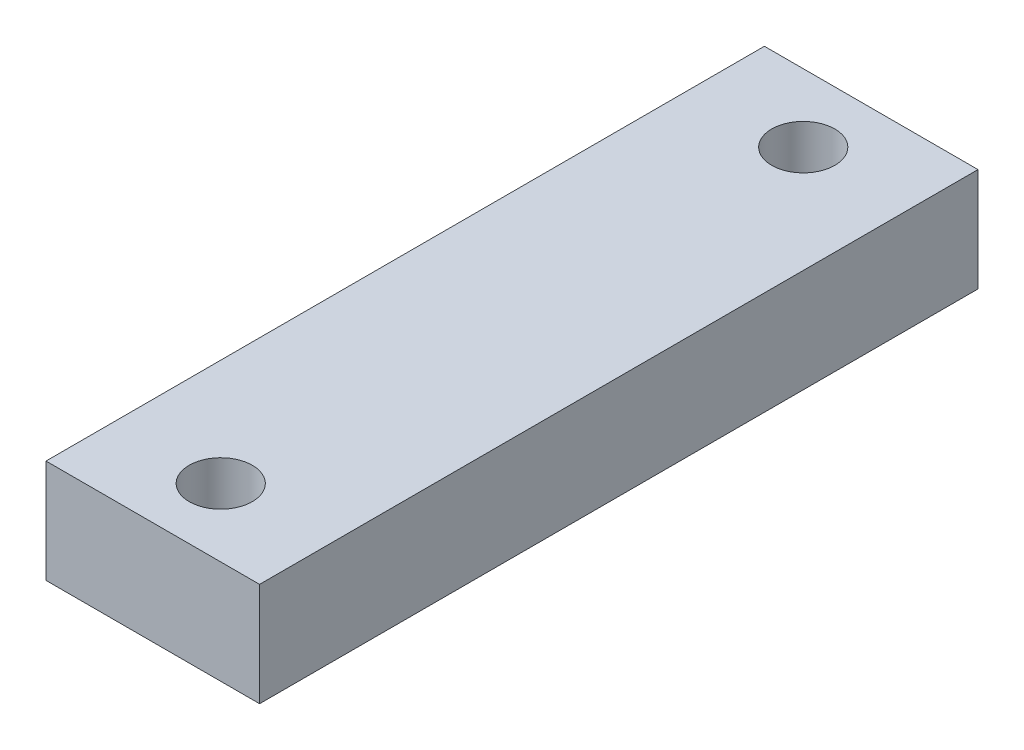
ISO-10303-21;
HEADER;
FILE_DESCRIPTION(('STEP AP214'),'2;1');
FILE_NAME('part.step','',(''),(''),'','','');
FILE_SCHEMA(('AUTOMOTIVE_DESIGN { 1 0 10303 214 1 1 1 1 }'));
ENDSEC;
DATA;
#1=APPLICATION_CONTEXT('core data for automotive mechanical design processes');
#2=APPLICATION_PROTOCOL_DEFINITION('international standard','automotive_design',2000,#1);
#3=PRODUCT_CONTEXT('',#1,'mechanical');
#4=PRODUCT('Part','Part','',(#3));
#5=PRODUCT_RELATED_PRODUCT_CATEGORY('part','',(#4));
#6=PRODUCT_DEFINITION_FORMATION('','',#4);
#7=PRODUCT_DEFINITION_CONTEXT('part definition',#1,'design');
#8=PRODUCT_DEFINITION('design','',#6,#7);
#9=PRODUCT_DEFINITION_SHAPE('','',#8);
#10=(LENGTH_UNIT() NAMED_UNIT(*) SI_UNIT(.MILLI.,.METRE.));
#11=(NAMED_UNIT(*) PLANE_ANGLE_UNIT() SI_UNIT($,.RADIAN.));
#12=(NAMED_UNIT(*) SI_UNIT($,.STERADIAN.) SOLID_ANGLE_UNIT());
#13=UNCERTAINTY_MEASURE_WITH_UNIT(LENGTH_MEASURE(1.E-05),#10,'distance_accuracy_value','');
#14=(GEOMETRIC_REPRESENTATION_CONTEXT(3) GLOBAL_UNCERTAINTY_ASSIGNED_CONTEXT((#13)) GLOBAL_UNIT_ASSIGNED_CONTEXT((#10,
#11,#12)) REPRESENTATION_CONTEXT('',''));
#15=CARTESIAN_POINT('',(0.,0.,0.));
#16=DIRECTION('',(0.,0.,1.));
#17=DIRECTION('',(1.,0.,0.));
#18=AXIS2_PLACEMENT_3D('',#15,#16,#17);
#19=CARTESIAN_POINT('',(6.99999999999999,-5.325,74.));
#20=DIRECTION('',(1.,0.,0.));
#21=DIRECTION('',(0.,0.,-1.));
#22=AXIS2_PLACEMENT_3D('',#19,#20,#21);
#23=PLANE('',#22);
#24=DIRECTION('',(0.,-1.,0.));
#25=VECTOR('',#24,1.);
#26=CARTESIAN_POINT('',(6.99999999999999,-5.325,0.));
#27=LINE('',#26,#25);
#28=CARTESIAN_POINT('',(6.99999999999999,5.32499999999999,0.));
#29=VERTEX_POINT('',#28);
#30=CARTESIAN_POINT('',(6.99999999999999,-5.325,0.));
#31=VERTEX_POINT('',#30);
#32=EDGE_CURVE('E98',#29,#31,#27,.T.);
#33=ORIENTED_EDGE('',*,*,#32,.T.);
#34=DIRECTION('',(0.,0.,-1.));
#35=VECTOR('',#34,1.);
#36=CARTESIAN_POINT('',(6.99999999999999,-5.325,74.));
#37=LINE('',#36,#35);
#38=CARTESIAN_POINT('',(6.99999999999999,-5.325,74.));
#39=VERTEX_POINT('',#38);
#40=EDGE_CURVE('E11',#39,#31,#37,.T.);
#41=ORIENTED_EDGE('',*,*,#40,.F.);
#42=DIRECTION('',(0.,-1.,0.));
#43=VECTOR('',#42,1.);
#44=CARTESIAN_POINT('',(6.99999999999999,-5.325,74.));
#45=LINE('',#44,#43);
#46=CARTESIAN_POINT('',(6.99999999999999,5.32499999999999,74.));
#47=VERTEX_POINT('',#46);
#48=EDGE_CURVE('E86',#47,#39,#45,.T.);
#49=ORIENTED_EDGE('',*,*,#48,.F.);
#50=DIRECTION('',(0.,0.,-1.));
#51=VECTOR('',#50,1.);
#52=CARTESIAN_POINT('',(6.99999999999999,5.32499999999999,74.));
#53=LINE('',#52,#51);
#54=EDGE_CURVE('E94',#47,#29,#53,.T.);
#55=ORIENTED_EDGE('',*,*,#54,.T.);
#56=EDGE_LOOP('',(#33,#41,#49,#55));
#57=FACE_BOUND('',#56,.T.);
#58=ADVANCED_FACE('F35',(#57),#23,.F.);
#59=CARTESIAN_POINT('',(29.,-5.325,74.));
#60=DIRECTION('',(0.,1.,0.));
#61=DIRECTION('',(0.,0.,1.));
#62=AXIS2_PLACEMENT_3D('',#59,#60,#61);
#63=PLANE('',#62);
#64=CARTESIAN_POINT('',(18.,-5.325,7.));
#65=DIRECTION('',(0.,1.,0.));
#66=DIRECTION('',(0.,0.,1.));
#67=AXIS2_PLACEMENT_3D('',#64,#65,#66);
#68=CIRCLE('',#67,3.25);
#69=CARTESIAN_POINT('',(18.,-5.325,10.25));
#70=VERTEX_POINT('',#69);
#71=EDGE_CURVE('E101',#70,#70,#68,.F.);
#72=ORIENTED_EDGE('',*,*,#71,.F.);
#73=EDGE_LOOP('',(#72));
#74=FACE_BOUND('',#73,.T.);
#75=CARTESIAN_POINT('',(18.,-5.325,67.));
#76=DIRECTION('',(0.,1.,0.));
#77=DIRECTION('',(0.,0.,1.));
#78=AXIS2_PLACEMENT_3D('',#75,#76,#77);
#79=CIRCLE('',#78,3.25);
#80=CARTESIAN_POINT('',(18.,-5.325,70.25));
#81=VERTEX_POINT('',#80);
#82=EDGE_CURVE('E112',#81,#81,#79,.F.);
#83=ORIENTED_EDGE('',*,*,#82,.F.);
#84=EDGE_LOOP('',(#83));
#85=FACE_BOUND('',#84,.T.);
#86=DIRECTION('',(1.,0.,0.));
#87=VECTOR('',#86,1.);
#88=CARTESIAN_POINT('',(29.,-5.325,0.));
#89=LINE('',#88,#87);
#90=CARTESIAN_POINT('',(29.,-5.325,0.));
#91=VERTEX_POINT('',#90);
#92=EDGE_CURVE('E90',#31,#91,#89,.T.);
#93=ORIENTED_EDGE('',*,*,#92,.T.);
#94=DIRECTION('',(0.,0.,-1.));
#95=VECTOR('',#94,1.);
#96=CARTESIAN_POINT('',(29.,-5.325,74.));
#97=LINE('',#96,#95);
#98=CARTESIAN_POINT('',(29.,-5.325,74.));
#99=VERTEX_POINT('',#98);
#100=EDGE_CURVE('E43',#99,#91,#97,.T.);
#101=ORIENTED_EDGE('',*,*,#100,.F.);
#102=DIRECTION('',(1.,0.,0.));
#103=VECTOR('',#102,1.);
#104=CARTESIAN_POINT('',(29.,-5.325,74.));
#105=LINE('',#104,#103);
#106=EDGE_CURVE('E81',#39,#99,#105,.T.);
#107=ORIENTED_EDGE('',*,*,#106,.F.);
#108=ORIENTED_EDGE('',*,*,#40,.T.);
#109=EDGE_LOOP('',(#93,#101,#107,#108));
#110=FACE_BOUND('',#109,.T.);
#111=ADVANCED_FACE('F89',(#74,#85,#110),#63,.F.);
#112=CARTESIAN_POINT('',(29.,-5.325,74.));
#113=DIRECTION('',(-1.,0.,0.));
#114=DIRECTION('',(0.,-1.,0.));
#115=AXIS2_PLACEMENT_3D('',#112,#113,#114);
#116=PLANE('',#115);
#117=DIRECTION('',(0.,1.,0.));
#118=VECTOR('',#117,1.);
#119=CARTESIAN_POINT('',(29.,-5.325,0.));
#120=LINE('',#119,#118);
#121=CARTESIAN_POINT('',(29.,5.325,0.));
#122=VERTEX_POINT('',#121);
#123=EDGE_CURVE('E68',#91,#122,#120,.T.);
#124=ORIENTED_EDGE('',*,*,#123,.T.);
#125=DIRECTION('',(0.,0.,-1.));
#126=VECTOR('',#125,1.);
#127=CARTESIAN_POINT('',(29.,5.325,74.));
#128=LINE('',#127,#126);
#129=CARTESIAN_POINT('',(29.,5.325,74.));
#130=VERTEX_POINT('',#129);
#131=EDGE_CURVE('E91',#130,#122,#128,.T.);
#132=ORIENTED_EDGE('',*,*,#131,.F.);
#133=DIRECTION('',(0.,1.,0.));
#134=VECTOR('',#133,1.);
#135=CARTESIAN_POINT('',(29.,-5.325,74.));
#136=LINE('',#135,#134);
#137=EDGE_CURVE('E84',#99,#130,#136,.T.);
#138=ORIENTED_EDGE('',*,*,#137,.F.);
#139=ORIENTED_EDGE('',*,*,#100,.T.);
#140=EDGE_LOOP('',(#124,#132,#138,#139));
#141=FACE_BOUND('',#140,.T.);
#142=ADVANCED_FACE('F92',(#141),#116,.F.);
#143=CARTESIAN_POINT('',(29.,5.325,74.));
#144=DIRECTION('',(0.,-1.,0.));
#145=DIRECTION('',(1.,0.,0.));
#146=AXIS2_PLACEMENT_3D('',#143,#144,#145);
#147=PLANE('',#146);
#148=CARTESIAN_POINT('',(18.,5.325,7.));
#149=DIRECTION('',(0.,1.,0.));
#150=DIRECTION('',(-1.,0.,0.));
#151=AXIS2_PLACEMENT_3D('',#148,#149,#150);
#152=CIRCLE('',#151,3.25);
#153=CARTESIAN_POINT('',(14.75,5.325,7.));
#154=VERTEX_POINT('',#153);
#155=EDGE_CURVE('E115',#154,#154,#152,.T.);
#156=ORIENTED_EDGE('',*,*,#155,.F.);
#157=EDGE_LOOP('',(#156));
#158=FACE_BOUND('',#157,.T.);
#159=CARTESIAN_POINT('',(18.,5.325,67.));
#160=DIRECTION('',(0.,1.,0.));
#161=DIRECTION('',(-1.,0.,0.));
#162=AXIS2_PLACEMENT_3D('',#159,#160,#161);
#163=CIRCLE('',#162,3.25);
#164=CARTESIAN_POINT('',(14.75,5.325,67.));
#165=VERTEX_POINT('',#164);
#166=EDGE_CURVE('E116',#165,#165,#163,.T.);
#167=ORIENTED_EDGE('',*,*,#166,.F.);
#168=EDGE_LOOP('',(#167));
#169=FACE_BOUND('',#168,.T.);
#170=DIRECTION('',(-1.,0.,0.));
#171=VECTOR('',#170,1.);
#172=CARTESIAN_POINT('',(29.,5.325,0.));
#173=LINE('',#172,#171);
#174=EDGE_CURVE('E74',#122,#29,#173,.T.);
#175=ORIENTED_EDGE('',*,*,#174,.T.);
#176=ORIENTED_EDGE('',*,*,#54,.F.);
#177=DIRECTION('',(-1.,0.,0.));
#178=VECTOR('',#177,1.);
#179=CARTESIAN_POINT('',(29.,5.325,74.));
#180=LINE('',#179,#178);
#181=EDGE_CURVE('E51',#130,#47,#180,.T.);
#182=ORIENTED_EDGE('',*,*,#181,.F.);
#183=ORIENTED_EDGE('',*,*,#131,.T.);
#184=EDGE_LOOP('',(#175,#176,#182,#183));
#185=FACE_BOUND('',#184,.T.);
#186=ADVANCED_FACE('F106',(#158,#169,#185),#147,.F.);
#187=CARTESIAN_POINT('',(0.,0.,74.));
#188=DIRECTION('',(0.,0.,1.));
#189=DIRECTION('',(1.,0.,0.));
#190=AXIS2_PLACEMENT_3D('',#187,#188,#189);
#191=PLANE('',#190);
#192=ORIENTED_EDGE('',*,*,#48,.T.);
#193=ORIENTED_EDGE('',*,*,#106,.T.);
#194=ORIENTED_EDGE('',*,*,#137,.T.);
#195=ORIENTED_EDGE('',*,*,#181,.T.);
#196=EDGE_LOOP('',(#192,#193,#194,#195));
#197=FACE_BOUND('',#196,.T.);
#198=ADVANCED_FACE('F82',(#197),#191,.T.);
#199=CARTESIAN_POINT('',(0.,0.,0.));
#200=DIRECTION('',(0.,0.,1.));
#201=DIRECTION('',(1.,0.,0.));
#202=AXIS2_PLACEMENT_3D('',#199,#200,#201);
#203=PLANE('',#202);
#204=ORIENTED_EDGE('',*,*,#32,.F.);
#205=ORIENTED_EDGE('',*,*,#174,.F.);
#206=ORIENTED_EDGE('',*,*,#123,.F.);
#207=ORIENTED_EDGE('',*,*,#92,.F.);
#208=EDGE_LOOP('',(#204,#205,#206,#207));
#209=FACE_BOUND('',#208,.T.);
#210=ADVANCED_FACE('F109',(#209),#203,.F.);
#211=CARTESIAN_POINT('',(18.,-5.326,67.));
#212=DIRECTION('',(0.,1.,0.));
#213=DIRECTION('',(-1.,0.,0.));
#214=AXIS2_PLACEMENT_3D('',#211,#212,#213);
#215=CYLINDRICAL_SURFACE('',#214,3.25);
#216=ORIENTED_EDGE('',*,*,#166,.T.);
#217=EDGE_LOOP('',(#216));
#218=FACE_BOUND('',#217,.T.);
#219=ORIENTED_EDGE('',*,*,#82,.T.);
#220=EDGE_LOOP('',(#219));
#221=FACE_BOUND('',#220,.T.);
#222=ADVANCED_FACE('F132',(#218,#221),#215,.F.);
#223=CARTESIAN_POINT('',(18.,-5.326,7.));
#224=DIRECTION('',(0.,1.,0.));
#225=DIRECTION('',(-1.,0.,0.));
#226=AXIS2_PLACEMENT_3D('',#223,#224,#225);
#227=CYLINDRICAL_SURFACE('',#226,3.25);
#228=ORIENTED_EDGE('',*,*,#155,.T.);
#229=EDGE_LOOP('',(#228));
#230=FACE_BOUND('',#229,.T.);
#231=ORIENTED_EDGE('',*,*,#71,.T.);
#232=EDGE_LOOP('',(#231));
#233=FACE_BOUND('',#232,.T.);
#234=ADVANCED_FACE('F124',(#230,#233),#227,.F.);
#235=CLOSED_SHELL('',(#58,#111,#142,#186,#198,#210,#222,#234));
#236=MANIFOLD_SOLID_BREP('B2',#235);
#237=ADVANCED_BREP_SHAPE_REPRESENTATION('',(#18,#236),#14);
#238=SHAPE_DEFINITION_REPRESENTATION(#9,#237);
ENDSEC;
END-ISO-10303-21;
